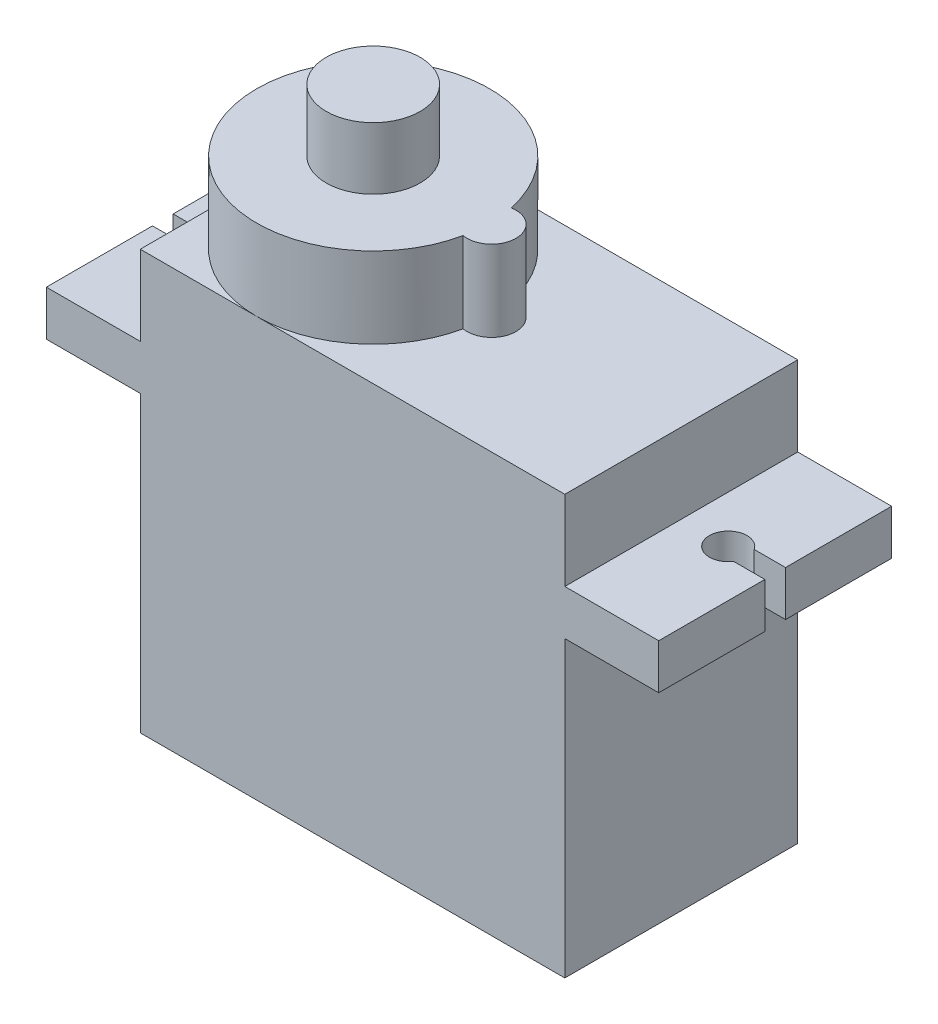
ISO-10303-21;
HEADER;
FILE_DESCRIPTION(('STEP AP214'),'2;1');
FILE_NAME('part.step','',(''),(''),'','','');
FILE_SCHEMA(('AUTOMOTIVE_DESIGN { 1 0 10303 214 1 1 1 1 }'));
ENDSEC;
DATA;
#1=APPLICATION_CONTEXT('core data for automotive mechanical design processes');
#2=APPLICATION_PROTOCOL_DEFINITION('international standard','automotive_design',2000,#1);
#3=PRODUCT_CONTEXT('',#1,'mechanical');
#4=PRODUCT('Part','Part','',(#3));
#5=PRODUCT_RELATED_PRODUCT_CATEGORY('part','',(#4));
#6=PRODUCT_DEFINITION_FORMATION('','',#4);
#7=PRODUCT_DEFINITION_CONTEXT('part definition',#1,'design');
#8=PRODUCT_DEFINITION('design','',#6,#7);
#9=PRODUCT_DEFINITION_SHAPE('','',#8);
#10=(LENGTH_UNIT() NAMED_UNIT(*) SI_UNIT(.MILLI.,.METRE.));
#11=(NAMED_UNIT(*) PLANE_ANGLE_UNIT() SI_UNIT($,.RADIAN.));
#12=(NAMED_UNIT(*) SI_UNIT($,.STERADIAN.) SOLID_ANGLE_UNIT());
#13=UNCERTAINTY_MEASURE_WITH_UNIT(LENGTH_MEASURE(1.E-05),#10,'distance_accuracy_value','');
#14=(GEOMETRIC_REPRESENTATION_CONTEXT(3) GLOBAL_UNCERTAINTY_ASSIGNED_CONTEXT((#13)) GLOBAL_UNIT_ASSIGNED_CONTEXT((#10,
#11,#12)) REPRESENTATION_CONTEXT('',''));
#15=CARTESIAN_POINT('',(0.,0.,0.));
#16=DIRECTION('',(0.,0.,1.));
#17=DIRECTION('',(1.,0.,0.));
#18=AXIS2_PLACEMENT_3D('',#15,#16,#17);
#19=CARTESIAN_POINT('',(-13.6,4.5,1.2));
#20=DIRECTION('',(1.,0.,0.));
#21=DIRECTION('',(0.,0.,-1.));
#22=AXIS2_PLACEMENT_3D('',#19,#20,#21);
#23=CYLINDRICAL_SURFACE('',#22,0.6);
#24=CARTESIAN_POINT('',(-13.6,4.5,1.2));
#25=DIRECTION('',(-1.,0.,0.));
#26=DIRECTION('',(0.,0.,1.));
#27=AXIS2_PLACEMENT_3D('',#24,#25,#26);
#28=CIRCLE('',#27,0.6);
#29=CARTESIAN_POINT('',(-13.6,4.5,1.8));
#30=VERTEX_POINT('',#29);
#31=EDGE_CURVE('E12',#30,#30,#28,.T.);
#32=ORIENTED_EDGE('',*,*,#31,.F.);
#33=EDGE_LOOP('',(#32));
#34=FACE_BOUND('',#33,.T.);
#35=CARTESIAN_POINT('',(-11.3,4.5,1.2));
#36=DIRECTION('',(-1.,0.,0.));
#37=DIRECTION('',(0.,0.,1.));
#38=AXIS2_PLACEMENT_3D('',#35,#36,#37);
#39=CIRCLE('',#38,0.6);
#40=CARTESIAN_POINT('',(-11.3,4.5,1.8));
#41=VERTEX_POINT('',#40);
#42=EDGE_CURVE('E54',#41,#41,#39,.T.);
#43=ORIENTED_EDGE('',*,*,#42,.T.);
#44=EDGE_LOOP('',(#43));
#45=FACE_BOUND('',#44,.T.);
#46=ADVANCED_FACE('F51',(#34,#45),#23,.T.);
#47=CARTESIAN_POINT('',(-13.6,0.,0.));
#48=DIRECTION('',(-1.,0.,0.));
#49=DIRECTION('',(0.,0.,1.));
#50=AXIS2_PLACEMENT_3D('',#47,#48,#49);
#51=PLANE('',#50);
#52=ORIENTED_EDGE('',*,*,#31,.T.);
#53=EDGE_LOOP('',(#52));
#54=FACE_BOUND('',#53,.T.);
#55=ADVANCED_FACE('F66',(#54),#51,.T.);
#56=CARTESIAN_POINT('',(-11.3,0.,0.));
#57=DIRECTION('',(-1.,0.,0.));
#58=DIRECTION('',(0.,0.,1.));
#59=AXIS2_PLACEMENT_3D('',#56,#57,#58);
#60=PLANE('',#59);
#61=ORIENTED_EDGE('',*,*,#42,.F.);
#62=EDGE_LOOP('',(#61));
#63=FACE_BOUND('',#62,.T.);
#64=ADVANCED_FACE('F64',(#63),#60,.F.);
#65=CLOSED_SHELL('',(#46,#55,#64));
#66=MANIFOLD_SOLID_BREP('B2',#65);
#67=CARTESIAN_POINT('',(-13.6,4.5,-1.2));
#68=DIRECTION('',(1.,0.,0.));
#69=DIRECTION('',(0.,0.,-1.));
#70=AXIS2_PLACEMENT_3D('',#67,#68,#69);
#71=CYLINDRICAL_SURFACE('',#70,0.6);
#72=CARTESIAN_POINT('',(-13.6,4.5,-1.2));
#73=DIRECTION('',(-1.,0.,0.));
#74=DIRECTION('',(0.,0.,1.));
#75=AXIS2_PLACEMENT_3D('',#72,#73,#74);
#76=CIRCLE('',#75,0.6);
#77=CARTESIAN_POINT('',(-13.6,4.5,-0.600000000000001));
#78=VERTEX_POINT('',#77);
#79=EDGE_CURVE('E50',#78,#78,#76,.T.);
#80=ORIENTED_EDGE('',*,*,#79,.F.);
#81=EDGE_LOOP('',(#80));
#82=FACE_BOUND('',#81,.T.);
#83=CARTESIAN_POINT('',(-11.3,4.5,-1.2));
#84=DIRECTION('',(-1.,0.,0.));
#85=DIRECTION('',(0.,0.,1.));
#86=AXIS2_PLACEMENT_3D('',#83,#84,#85);
#87=CIRCLE('',#86,0.6);
#88=CARTESIAN_POINT('',(-11.3,4.5,-0.600000000000001));
#89=VERTEX_POINT('',#88);
#90=EDGE_CURVE('E106',#89,#89,#87,.T.);
#91=ORIENTED_EDGE('',*,*,#90,.T.);
#92=EDGE_LOOP('',(#91));
#93=FACE_BOUND('',#92,.T.);
#94=ADVANCED_FACE('F103',(#82,#93),#71,.T.);
#95=CARTESIAN_POINT('',(-13.6,0.,0.));
#96=DIRECTION('',(-1.,0.,0.));
#97=DIRECTION('',(0.,0.,1.));
#98=AXIS2_PLACEMENT_3D('',#95,#96,#97);
#99=PLANE('',#98);
#100=ORIENTED_EDGE('',*,*,#79,.T.);
#101=EDGE_LOOP('',(#100));
#102=FACE_BOUND('',#101,.T.);
#103=ADVANCED_FACE('F118',(#102),#99,.T.);
#104=CARTESIAN_POINT('',(-11.3,0.,0.));
#105=DIRECTION('',(-1.,0.,0.));
#106=DIRECTION('',(0.,0.,1.));
#107=AXIS2_PLACEMENT_3D('',#104,#105,#106);
#108=PLANE('',#107);
#109=ORIENTED_EDGE('',*,*,#90,.F.);
#110=EDGE_LOOP('',(#109));
#111=FACE_BOUND('',#110,.T.);
#112=ADVANCED_FACE('F116',(#111),#108,.F.);
#113=CLOSED_SHELL('',(#94,#103,#112));
#114=MANIFOLD_SOLID_BREP('B7',#113);
#115=CARTESIAN_POINT('',(-13.6,4.5,0.));
#116=DIRECTION('',(1.,0.,0.));
#117=DIRECTION('',(0.,0.,-1.));
#118=AXIS2_PLACEMENT_3D('',#115,#116,#117);
#119=CYLINDRICAL_SURFACE('',#118,0.6);
#120=CARTESIAN_POINT('',(-13.6,4.5,0.));
#121=DIRECTION('',(-1.,0.,0.));
#122=DIRECTION('',(0.,0.,1.));
#123=AXIS2_PLACEMENT_3D('',#120,#121,#122);
#124=CIRCLE('',#123,0.6);
#125=CARTESIAN_POINT('',(-13.6,4.5,0.599999999999999));
#126=VERTEX_POINT('',#125);
#127=EDGE_CURVE('E102',#126,#126,#124,.T.);
#128=ORIENTED_EDGE('',*,*,#127,.F.);
#129=EDGE_LOOP('',(#128));
#130=FACE_BOUND('',#129,.T.);
#131=CARTESIAN_POINT('',(-11.3,4.5,0.));
#132=DIRECTION('',(-1.,0.,0.));
#133=DIRECTION('',(0.,0.,1.));
#134=AXIS2_PLACEMENT_3D('',#131,#132,#133);
#135=CIRCLE('',#134,0.6);
#136=CARTESIAN_POINT('',(-11.3,4.5,0.599999999999999));
#137=VERTEX_POINT('',#136);
#138=EDGE_CURVE('E159',#137,#137,#135,.T.);
#139=ORIENTED_EDGE('',*,*,#138,.T.);
#140=EDGE_LOOP('',(#139));
#141=FACE_BOUND('',#140,.T.);
#142=ADVANCED_FACE('F156',(#130,#141),#119,.T.);
#143=CARTESIAN_POINT('',(-13.6,0.,0.));
#144=DIRECTION('',(-1.,0.,0.));
#145=DIRECTION('',(0.,0.,1.));
#146=AXIS2_PLACEMENT_3D('',#143,#144,#145);
#147=PLANE('',#146);
#148=ORIENTED_EDGE('',*,*,#127,.T.);
#149=EDGE_LOOP('',(#148));
#150=FACE_BOUND('',#149,.T.);
#151=ADVANCED_FACE('F171',(#150),#147,.T.);
#152=CARTESIAN_POINT('',(-11.3,0.,0.));
#153=DIRECTION('',(-1.,0.,0.));
#154=DIRECTION('',(0.,0.,1.));
#155=AXIS2_PLACEMENT_3D('',#152,#153,#154);
#156=PLANE('',#155);
#157=ORIENTED_EDGE('',*,*,#138,.F.);
#158=EDGE_LOOP('',(#157));
#159=FACE_BOUND('',#158,.T.);
#160=ADVANCED_FACE('F169',(#159),#156,.F.);
#161=CLOSED_SHELL('',(#142,#151,#160));
#162=MANIFOLD_SOLID_BREP('B45',#161);
#163=CARTESIAN_POINT('',(0.,22.3,0.));
#164=DIRECTION('',(0.,-1.,0.));
#165=DIRECTION('',(0.,0.,-1.));
#166=AXIS2_PLACEMENT_3D('',#163,#164,#165);
#167=PLANE('',#166);
#168=CARTESIAN_POINT('',(1.2,22.3,0.));
#169=DIRECTION('',(0.,1.,0.));
#170=DIRECTION('',(0.,0.,1.));
#171=AXIS2_PLACEMENT_3D('',#168,#169,#170);
#172=CIRCLE('',#171,1.3);
#173=CARTESIAN_POINT('',(0.966666666666667,22.3,1.27888840621673));
#174=VERTEX_POINT('',#173);
#175=CARTESIAN_POINT('',(0.966666666666667,22.3,-1.27888840621673));
#176=VERTEX_POINT('',#175);
#177=EDGE_CURVE('E375',#174,#176,#172,.T.);
#178=ORIENTED_EDGE('',*,*,#177,.F.);
#179=CARTESIAN_POINT('',(-5.1,22.3,0.));
#180=DIRECTION('',(0.,1.,0.));
#181=DIRECTION('',(0.,0.,1.));
#182=AXIS2_PLACEMENT_3D('',#179,#180,#181);
#183=CIRCLE('',#182,6.2);
#184=CARTESIAN_POINT('',(-5.1,22.3,6.2));
#185=VERTEX_POINT('',#184);
#186=EDGE_CURVE('E223',#185,#174,#183,.T.);
#187=ORIENTED_EDGE('',*,*,#186,.F.);
#188=DIRECTION('',(1.,0.,0.));
#189=VECTOR('',#188,1.);
#190=CARTESIAN_POINT('',(-11.3,22.3,6.2));
#191=LINE('',#190,#189);
#192=CARTESIAN_POINT('',(11.3,22.3,6.2));
#193=VERTEX_POINT('',#192);
#194=EDGE_CURVE('E503',#185,#193,#191,.T.);
#195=ORIENTED_EDGE('',*,*,#194,.T.);
#196=DIRECTION('',(0.,0.,-1.));
#197=VECTOR('',#196,1.);
#198=CARTESIAN_POINT('',(11.3,22.3,6.2));
#199=LINE('',#198,#197);
#200=CARTESIAN_POINT('',(11.3,22.3,-6.2));
#201=VERTEX_POINT('',#200);
#202=EDGE_CURVE('E492',#193,#201,#199,.T.);
#203=ORIENTED_EDGE('',*,*,#202,.T.);
#204=DIRECTION('',(-1.,0.,0.));
#205=VECTOR('',#204,1.);
#206=CARTESIAN_POINT('',(-11.3,22.3,-6.2));
#207=LINE('',#206,#205);
#208=CARTESIAN_POINT('',(-5.1,22.3,-6.2));
#209=VERTEX_POINT('',#208);
#210=EDGE_CURVE('E497',#201,#209,#207,.T.);
#211=ORIENTED_EDGE('',*,*,#210,.T.);
#212=EDGE_CURVE('E217',#176,#209,#183,.T.);
#213=ORIENTED_EDGE('',*,*,#212,.F.);
#214=EDGE_LOOP('',(#178,#187,#195,#203,#211,#213));
#215=FACE_BOUND('',#214,.T.);
#216=ADVANCED_FACE('F200',(#215),#167,.F.);
#217=CARTESIAN_POINT('',(-11.3,22.3,0.));
#218=VERTEX_POINT('',#217);
#219=EDGE_CURVE('E209',#209,#218,#183,.T.);
#220=ORIENTED_EDGE('',*,*,#219,.F.);
#221=CARTESIAN_POINT('',(-11.3,22.3,-6.2));
#222=VERTEX_POINT('',#221);
#223=EDGE_CURVE('E495',#209,#222,#207,.T.);
#224=ORIENTED_EDGE('',*,*,#223,.T.);
#225=DIRECTION('',(0.,0.,1.));
#226=VECTOR('',#225,1.);
#227=CARTESIAN_POINT('',(-11.3,22.3,6.2));
#228=LINE('',#227,#226);
#229=EDGE_CURVE('E500',#222,#218,#228,.T.);
#230=ORIENTED_EDGE('',*,*,#229,.T.);
#231=EDGE_LOOP('',(#220,#224,#230));
#232=FACE_BOUND('',#231,.T.);
#233=ADVANCED_FACE('F593',(#232),#167,.F.);
#234=CARTESIAN_POINT('',(16.3,0.,0.));
#235=DIRECTION('',(1.,0.,0.));
#236=DIRECTION('',(0.,0.,-1.));
#237=AXIS2_PLACEMENT_3D('',#234,#235,#236);
#238=PLANE('',#237);
#239=DIRECTION('',(0.,1.,0.));
#240=VECTOR('',#239,1.);
#241=CARTESIAN_POINT('',(16.3,-0.001000000000001,-0.550000000000001));
#242=LINE('',#241,#240);
#243=CARTESIAN_POINT('',(16.3,15.65,-0.550000000000001));
#244=VERTEX_POINT('',#243);
#245=CARTESIAN_POINT('',(16.3,18.05,-0.550000000000001));
#246=VERTEX_POINT('',#245);
#247=EDGE_CURVE('E402',#244,#246,#242,.T.);
#248=ORIENTED_EDGE('',*,*,#247,.F.);
#249=DIRECTION('',(0.,0.,-1.));
#250=VECTOR('',#249,1.);
#251=CARTESIAN_POINT('',(16.3,15.65,6.2));
#252=LINE('',#251,#250);
#253=CARTESIAN_POINT('',(16.3,15.65,-6.2));
#254=VERTEX_POINT('',#253);
#255=EDGE_CURVE('E464',#244,#254,#252,.T.);
#256=ORIENTED_EDGE('',*,*,#255,.T.);
#257=DIRECTION('',(0.,1.,0.));
#258=VECTOR('',#257,1.);
#259=CARTESIAN_POINT('',(16.3,18.05,-6.2));
#260=LINE('',#259,#258);
#261=CARTESIAN_POINT('',(16.3,18.05,-6.2));
#262=VERTEX_POINT('',#261);
#263=EDGE_CURVE('E469',#254,#262,#260,.T.);
#264=ORIENTED_EDGE('',*,*,#263,.T.);
#265=DIRECTION('',(0.,0.,1.));
#266=VECTOR('',#265,1.);
#267=CARTESIAN_POINT('',(16.3,18.05,6.2));
#268=LINE('',#267,#266);
#269=EDGE_CURVE('E472',#262,#246,#268,.T.);
#270=ORIENTED_EDGE('',*,*,#269,.T.);
#271=EDGE_LOOP('',(#248,#256,#264,#270));
#272=FACE_BOUND('',#271,.T.);
#273=ADVANCED_FACE('F598',(#272),#238,.T.);
#274=CARTESIAN_POINT('',(-16.3,0.,0.));
#275=DIRECTION('',(-1.,0.,0.));
#276=DIRECTION('',(0.,0.,1.));
#277=AXIS2_PLACEMENT_3D('',#274,#275,#276);
#278=PLANE('',#277);
#279=DIRECTION('',(0.,1.,0.));
#280=VECTOR('',#279,1.);
#281=CARTESIAN_POINT('',(-16.3,-0.001000000000001,-0.55));
#282=LINE('',#281,#280);
#283=CARTESIAN_POINT('',(-16.3,15.65,-0.55));
#284=VERTEX_POINT('',#283);
#285=CARTESIAN_POINT('',(-16.3,18.05,-0.55));
#286=VERTEX_POINT('',#285);
#287=EDGE_CURVE('E422',#284,#286,#282,.T.);
#288=ORIENTED_EDGE('',*,*,#287,.T.);
#289=DIRECTION('',(0.,0.,-1.));
#290=VECTOR('',#289,1.);
#291=CARTESIAN_POINT('',(-16.3,18.05,6.2));
#292=LINE('',#291,#290);
#293=CARTESIAN_POINT('',(-16.3,18.05,-6.2));
#294=VERTEX_POINT('',#293);
#295=EDGE_CURVE('E435',#286,#294,#292,.T.);
#296=ORIENTED_EDGE('',*,*,#295,.T.);
#297=DIRECTION('',(0.,-1.,0.));
#298=VECTOR('',#297,1.);
#299=CARTESIAN_POINT('',(-16.3,18.05,-6.2));
#300=LINE('',#299,#298);
#301=CARTESIAN_POINT('',(-16.3,15.65,-6.2));
#302=VERTEX_POINT('',#301);
#303=EDGE_CURVE('E434',#294,#302,#300,.T.);
#304=ORIENTED_EDGE('',*,*,#303,.T.);
#305=DIRECTION('',(0.,0.,1.));
#306=VECTOR('',#305,1.);
#307=CARTESIAN_POINT('',(-16.3,15.65,-6.2));
#308=LINE('',#307,#306);
#309=EDGE_CURVE('E438',#302,#284,#308,.T.);
#310=ORIENTED_EDGE('',*,*,#309,.T.);
#311=EDGE_LOOP('',(#288,#296,#304,#310));
#312=FACE_BOUND('',#311,.T.);
#313=ADVANCED_FACE('F615',(#312),#278,.T.);
#314=CARTESIAN_POINT('',(-11.3,22.3,6.2));
#315=DIRECTION('',(1.,0.,0.));
#316=DIRECTION('',(0.,0.,-1.));
#317=AXIS2_PLACEMENT_3D('',#314,#315,#316);
#318=PLANE('',#317);
#319=DIRECTION('',(0.,0.,-1.));
#320=VECTOR('',#319,1.);
#321=CARTESIAN_POINT('',(-11.3,18.05,6.2));
#322=LINE('',#321,#320);
#323=CARTESIAN_POINT('',(-11.3,18.05,6.2));
#324=VERTEX_POINT('',#323);
#325=CARTESIAN_POINT('',(-11.3,18.05,-6.2));
#326=VERTEX_POINT('',#325);
#327=EDGE_CURVE('E409',#324,#326,#322,.T.);
#328=ORIENTED_EDGE('',*,*,#327,.F.);
#329=DIRECTION('',(0.,-1.,0.));
#330=VECTOR('',#329,1.);
#331=CARTESIAN_POINT('',(-11.3,22.3,6.2));
#332=LINE('',#331,#330);
#333=CARTESIAN_POINT('',(-11.3,22.3,6.2));
#334=VERTEX_POINT('',#333);
#335=EDGE_CURVE('E521',#334,#324,#332,.T.);
#336=ORIENTED_EDGE('',*,*,#335,.F.);
#337=EDGE_CURVE('E499',#218,#334,#228,.T.);
#338=ORIENTED_EDGE('',*,*,#337,.F.);
#339=ORIENTED_EDGE('',*,*,#229,.F.);
#340=DIRECTION('',(0.,-1.,0.));
#341=VECTOR('',#340,1.);
#342=CARTESIAN_POINT('',(-11.3,22.3,-6.2));
#343=LINE('',#342,#341);
#344=EDGE_CURVE('E524',#222,#326,#343,.T.);
#345=ORIENTED_EDGE('',*,*,#344,.T.);
#346=EDGE_LOOP('',(#328,#336,#338,#339,#345));
#347=FACE_BOUND('',#346,.T.);
#348=ADVANCED_FACE('F563',(#347),#318,.F.);
#349=DIRECTION('',(0.,0.,1.));
#350=VECTOR('',#349,1.);
#351=CARTESIAN_POINT('',(-11.3,15.65,-6.2));
#352=LINE('',#351,#350);
#353=CARTESIAN_POINT('',(-11.3,15.65,-6.2));
#354=VERTEX_POINT('',#353);
#355=CARTESIAN_POINT('',(-11.3,15.65,6.2));
#356=VERTEX_POINT('',#355);
#357=EDGE_CURVE('E446',#354,#356,#352,.T.);
#358=ORIENTED_EDGE('',*,*,#357,.F.);
#359=CARTESIAN_POINT('',(-11.3,0.,-6.2));
#360=VERTEX_POINT('',#359);
#361=EDGE_CURVE('E523',#354,#360,#343,.T.);
#362=ORIENTED_EDGE('',*,*,#361,.T.);
#363=DIRECTION('',(0.,0.,1.));
#364=VECTOR('',#363,1.);
#365=CARTESIAN_POINT('',(-11.3,0.,6.2));
#366=LINE('',#365,#364);
#367=CARTESIAN_POINT('',(-11.3,0.,6.2));
#368=VERTEX_POINT('',#367);
#369=EDGE_CURVE('E513',#360,#368,#366,.T.);
#370=ORIENTED_EDGE('',*,*,#369,.T.);
#371=EDGE_CURVE('E520',#356,#368,#332,.T.);
#372=ORIENTED_EDGE('',*,*,#371,.F.);
#373=EDGE_LOOP('',(#358,#362,#370,#372));
#374=FACE_BOUND('',#373,.T.);
#375=ADVANCED_FACE('F531',(#374),#318,.F.);
#376=CARTESIAN_POINT('',(11.3,22.3,6.2));
#377=DIRECTION('',(-1.,0.,0.));
#378=DIRECTION('',(0.,0.,1.));
#379=AXIS2_PLACEMENT_3D('',#376,#377,#378);
#380=PLANE('',#379);
#381=DIRECTION('',(0.,0.,1.));
#382=VECTOR('',#381,1.);
#383=CARTESIAN_POINT('',(11.3,18.05,6.2));
#384=LINE('',#383,#382);
#385=CARTESIAN_POINT('',(11.3,18.05,-6.2));
#386=VERTEX_POINT('',#385);
#387=CARTESIAN_POINT('',(11.3,18.05,6.2));
#388=VERTEX_POINT('',#387);
#389=EDGE_CURVE('E465',#386,#388,#384,.T.);
#390=ORIENTED_EDGE('',*,*,#389,.F.);
#391=DIRECTION('',(0.,-1.,0.));
#392=VECTOR('',#391,1.);
#393=CARTESIAN_POINT('',(11.3,22.3,-6.2));
#394=LINE('',#393,#392);
#395=EDGE_CURVE('E204',#201,#386,#394,.T.);
#396=ORIENTED_EDGE('',*,*,#395,.F.);
#397=ORIENTED_EDGE('',*,*,#202,.F.);
#398=DIRECTION('',(0.,-1.,0.));
#399=VECTOR('',#398,1.);
#400=CARTESIAN_POINT('',(11.3,22.3,6.2));
#401=LINE('',#400,#399);
#402=EDGE_CURVE('E518',#193,#388,#401,.T.);
#403=ORIENTED_EDGE('',*,*,#402,.T.);
#404=EDGE_LOOP('',(#390,#396,#397,#403));
#405=FACE_BOUND('',#404,.T.);
#406=ADVANCED_FACE('F202',(#405),#380,.F.);
#407=DIRECTION('',(0.,0.,-1.));
#408=VECTOR('',#407,1.);
#409=CARTESIAN_POINT('',(11.3,15.65,6.2));
#410=LINE('',#409,#408);
#411=CARTESIAN_POINT('',(11.3,15.65,6.2));
#412=VERTEX_POINT('',#411);
#413=CARTESIAN_POINT('',(11.3,15.65,-6.2));
#414=VERTEX_POINT('',#413);
#415=EDGE_CURVE('E460',#412,#414,#410,.T.);
#416=ORIENTED_EDGE('',*,*,#415,.F.);
#417=CARTESIAN_POINT('',(11.3,0.,6.2));
#418=VERTEX_POINT('',#417);
#419=EDGE_CURVE('E507',#412,#418,#401,.T.);
#420=ORIENTED_EDGE('',*,*,#419,.T.);
#421=DIRECTION('',(0.,0.,-1.));
#422=VECTOR('',#421,1.);
#423=CARTESIAN_POINT('',(11.3,0.,6.2));
#424=LINE('',#423,#422);
#425=CARTESIAN_POINT('',(11.3,0.,-6.2));
#426=VERTEX_POINT('',#425);
#427=EDGE_CURVE('E491',#418,#426,#424,.T.);
#428=ORIENTED_EDGE('',*,*,#427,.T.);
#429=EDGE_CURVE('E525',#414,#426,#394,.T.);
#430=ORIENTED_EDGE('',*,*,#429,.F.);
#431=EDGE_LOOP('',(#416,#420,#428,#430));
#432=FACE_BOUND('',#431,.T.);
#433=ADVANCED_FACE('F612',(#432),#380,.F.);
#434=CARTESIAN_POINT('',(-11.3,22.3,-6.2));
#435=DIRECTION('',(0.,0.,1.));
#436=DIRECTION('',(1.,0.,0.));
#437=AXIS2_PLACEMENT_3D('',#434,#435,#436);
#438=PLANE('',#437);
#439=DIRECTION('',(-1.,0.,0.));
#440=VECTOR('',#439,1.);
#441=CARTESIAN_POINT('',(-11.3,0.,-6.2));
#442=LINE('',#441,#440);
#443=EDGE_CURVE('E510',#426,#360,#442,.T.);
#444=ORIENTED_EDGE('',*,*,#443,.T.);
#445=ORIENTED_EDGE('',*,*,#361,.F.);
#446=DIRECTION('',(1.,0.,0.));
#447=VECTOR('',#446,1.);
#448=CARTESIAN_POINT('',(-16.3,15.65,-6.2));
#449=LINE('',#448,#447);
#450=EDGE_CURVE('E454',#302,#354,#449,.T.);
#451=ORIENTED_EDGE('',*,*,#450,.F.);
#452=ORIENTED_EDGE('',*,*,#303,.F.);
#453=DIRECTION('',(1.,0.,0.));
#454=VECTOR('',#453,1.);
#455=CARTESIAN_POINT('',(-16.3,18.05,-6.2));
#456=LINE('',#455,#454);
#457=EDGE_CURVE('E457',#294,#326,#456,.T.);
#458=ORIENTED_EDGE('',*,*,#457,.T.);
#459=ORIENTED_EDGE('',*,*,#344,.F.);
#460=ORIENTED_EDGE('',*,*,#223,.F.);
#461=ORIENTED_EDGE('',*,*,#210,.F.);
#462=ORIENTED_EDGE('',*,*,#395,.T.);
#463=DIRECTION('',(-1.,0.,0.));
#464=VECTOR('',#463,1.);
#465=CARTESIAN_POINT('',(16.3,18.05,-6.2));
#466=LINE('',#465,#464);
#467=EDGE_CURVE('E482',#262,#386,#466,.T.);
#468=ORIENTED_EDGE('',*,*,#467,.F.);
#469=ORIENTED_EDGE('',*,*,#263,.F.);
#470=DIRECTION('',(-1.,0.,0.));
#471=VECTOR('',#470,1.);
#472=CARTESIAN_POINT('',(16.3,15.65,-6.2));
#473=LINE('',#472,#471);
#474=EDGE_CURVE('E485',#254,#414,#473,.T.);
#475=ORIENTED_EDGE('',*,*,#474,.T.);
#476=ORIENTED_EDGE('',*,*,#429,.T.);
#477=EDGE_LOOP('',(#444,#445,#451,#452,#458,#459,#460,#461,#462,#468,#469,#475,#476));
#478=FACE_BOUND('',#477,.T.);
#479=ADVANCED_FACE('F537',(#478),#438,.F.);
#480=CARTESIAN_POINT('',(-11.3,22.3,6.2));
#481=DIRECTION('',(0.,0.,-1.));
#482=DIRECTION('',(-1.,0.,0.));
#483=AXIS2_PLACEMENT_3D('',#480,#481,#482);
#484=PLANE('',#483);
#485=DIRECTION('',(1.,0.,0.));
#486=VECTOR('',#485,1.);
#487=CARTESIAN_POINT('',(-11.3,0.,6.2));
#488=LINE('',#487,#486);
#489=EDGE_CURVE('E496',#368,#418,#488,.T.);
#490=ORIENTED_EDGE('',*,*,#489,.T.);
#491=ORIENTED_EDGE('',*,*,#419,.F.);
#492=DIRECTION('',(-1.,0.,0.));
#493=VECTOR('',#492,1.);
#494=CARTESIAN_POINT('',(16.3,15.65,6.2));
#495=LINE('',#494,#493);
#496=CARTESIAN_POINT('',(16.3,15.65,6.2));
#497=VERTEX_POINT('',#496);
#498=EDGE_CURVE('E488',#497,#412,#495,.T.);
#499=ORIENTED_EDGE('',*,*,#498,.F.);
#500=DIRECTION('',(0.,-1.,0.));
#501=VECTOR('',#500,1.);
#502=CARTESIAN_POINT('',(16.3,18.05,6.2));
#503=LINE('',#502,#501);
#504=CARTESIAN_POINT('',(16.3,18.05,6.2));
#505=VERTEX_POINT('',#504);
#506=EDGE_CURVE('E461',#505,#497,#503,.T.);
#507=ORIENTED_EDGE('',*,*,#506,.F.);
#508=DIRECTION('',(-1.,0.,0.));
#509=VECTOR('',#508,1.);
#510=CARTESIAN_POINT('',(16.3,18.05,6.2));
#511=LINE('',#510,#509);
#512=EDGE_CURVE('E475',#505,#388,#511,.T.);
#513=ORIENTED_EDGE('',*,*,#512,.T.);
#514=ORIENTED_EDGE('',*,*,#402,.F.);
#515=ORIENTED_EDGE('',*,*,#194,.F.);
#516=EDGE_CURVE('E504',#334,#185,#191,.T.);
#517=ORIENTED_EDGE('',*,*,#516,.F.);
#518=ORIENTED_EDGE('',*,*,#335,.T.);
#519=DIRECTION('',(1.,0.,0.));
#520=VECTOR('',#519,1.);
#521=CARTESIAN_POINT('',(-16.3,18.05,6.2));
#522=LINE('',#521,#520);
#523=CARTESIAN_POINT('',(-16.3,18.05,6.2));
#524=VERTEX_POINT('',#523);
#525=EDGE_CURVE('E443',#524,#324,#522,.T.);
#526=ORIENTED_EDGE('',*,*,#525,.F.);
#527=DIRECTION('',(0.,1.,0.));
#528=VECTOR('',#527,1.);
#529=CARTESIAN_POINT('',(-16.3,15.65,6.2));
#530=LINE('',#529,#528);
#531=CARTESIAN_POINT('',(-16.3,15.65,6.2));
#532=VERTEX_POINT('',#531);
#533=EDGE_CURVE('E441',#532,#524,#530,.T.);
#534=ORIENTED_EDGE('',*,*,#533,.F.);
#535=DIRECTION('',(1.,0.,0.));
#536=VECTOR('',#535,1.);
#537=CARTESIAN_POINT('',(-16.3,15.65,6.2));
#538=LINE('',#537,#536);
#539=EDGE_CURVE('E451',#532,#356,#538,.T.);
#540=ORIENTED_EDGE('',*,*,#539,.T.);
#541=ORIENTED_EDGE('',*,*,#371,.T.);
#542=EDGE_LOOP('',(#490,#491,#499,#507,#513,#514,#515,#517,#518,#526,#534,#540,#541));
#543=FACE_BOUND('',#542,.T.);
#544=ADVANCED_FACE('F543',(#543),#484,.F.);
#545=EDGE_CURVE('E570',#218,#185,#183,.T.);
#546=ORIENTED_EDGE('',*,*,#545,.F.);
#547=ORIENTED_EDGE('',*,*,#337,.T.);
#548=ORIENTED_EDGE('',*,*,#516,.T.);
#549=EDGE_LOOP('',(#546,#547,#548));
#550=FACE_BOUND('',#549,.T.);
#551=ADVANCED_FACE('F569',(#550),#167,.F.);
#552=CARTESIAN_POINT('',(0.,0.,0.));
#553=DIRECTION('',(0.,-1.,0.));
#554=DIRECTION('',(0.,0.,-1.));
#555=AXIS2_PLACEMENT_3D('',#552,#553,#554);
#556=PLANE('',#555);
#557=ORIENTED_EDGE('',*,*,#427,.F.);
#558=ORIENTED_EDGE('',*,*,#489,.F.);
#559=ORIENTED_EDGE('',*,*,#369,.F.);
#560=ORIENTED_EDGE('',*,*,#443,.F.);
#561=EDGE_LOOP('',(#557,#558,#559,#560));
#562=FACE_BOUND('',#561,.T.);
#563=ADVANCED_FACE('F540',(#562),#556,.T.);
#564=CARTESIAN_POINT('',(16.3,15.65,6.2));
#565=DIRECTION('',(0.,1.,0.));
#566=DIRECTION('',(0.,0.,1.));
#567=AXIS2_PLACEMENT_3D('',#564,#565,#566);
#568=PLANE('',#567);
#569=ORIENTED_EDGE('',*,*,#255,.F.);
#570=DIRECTION('',(1.,0.,0.));
#571=VECTOR('',#570,1.);
#572=CARTESIAN_POINT('',(16.3,15.65,-0.550000000000001));
#573=LINE('',#572,#571);
#574=CARTESIAN_POINT('',(14.6351646544245,15.65,-0.550000000000001));
#575=VERTEX_POINT('',#574);
#576=EDGE_CURVE('E387',#575,#244,#573,.T.);
#577=ORIENTED_EDGE('',*,*,#576,.F.);
#578=CARTESIAN_POINT('',(13.8,15.65,0.));
#579=DIRECTION('',(0.,1.,0.));
#580=DIRECTION('',(0.,0.,1.));
#581=AXIS2_PLACEMENT_3D('',#578,#579,#580);
#582=CIRCLE('',#581,1.);
#583=CARTESIAN_POINT('',(14.6351646544245,15.65,0.549999999999999));
#584=VERTEX_POINT('',#583);
#585=EDGE_CURVE('E384',#584,#575,#582,.F.);
#586=ORIENTED_EDGE('',*,*,#585,.F.);
#587=DIRECTION('',(-1.,0.,0.));
#588=VECTOR('',#587,1.);
#589=CARTESIAN_POINT('',(16.3,15.65,0.549999999999999));
#590=LINE('',#589,#588);
#591=CARTESIAN_POINT('',(16.3,15.65,0.549999999999999));
#592=VERTEX_POINT('',#591);
#593=EDGE_CURVE('E401',#592,#584,#590,.T.);
#594=ORIENTED_EDGE('',*,*,#593,.F.);
#595=EDGE_CURVE('E466',#497,#592,#252,.T.);
#596=ORIENTED_EDGE('',*,*,#595,.F.);
#597=ORIENTED_EDGE('',*,*,#498,.T.);
#598=ORIENTED_EDGE('',*,*,#415,.T.);
#599=ORIENTED_EDGE('',*,*,#474,.F.);
#600=EDGE_LOOP('',(#569,#577,#586,#594,#596,#597,#598,#599));
#601=FACE_BOUND('',#600,.T.);
#602=ADVANCED_FACE('F607',(#601),#568,.F.);
#603=CARTESIAN_POINT('',(16.3,18.05,6.2));
#604=DIRECTION('',(0.,-1.,0.));
#605=DIRECTION('',(0.,0.,-1.));
#606=AXIS2_PLACEMENT_3D('',#603,#604,#605);
#607=PLANE('',#606);
#608=CARTESIAN_POINT('',(13.8,18.05,0.));
#609=DIRECTION('',(0.,1.,0.));
#610=DIRECTION('',(0.,0.,1.));
#611=AXIS2_PLACEMENT_3D('',#608,#609,#610);
#612=CIRCLE('',#611,1.);
#613=CARTESIAN_POINT('',(14.6351646544245,18.05,-0.550000000000001));
#614=VERTEX_POINT('',#613);
#615=CARTESIAN_POINT('',(14.6351646544245,18.05,0.549999999999999));
#616=VERTEX_POINT('',#615);
#617=EDGE_CURVE('E390',#614,#616,#612,.T.);
#618=ORIENTED_EDGE('',*,*,#617,.F.);
#619=DIRECTION('',(-1.,0.,0.));
#620=VECTOR('',#619,1.);
#621=CARTESIAN_POINT('',(16.3,18.05,-0.550000000000001));
#622=LINE('',#621,#620);
#623=EDGE_CURVE('E395',#246,#614,#622,.T.);
#624=ORIENTED_EDGE('',*,*,#623,.F.);
#625=ORIENTED_EDGE('',*,*,#269,.F.);
#626=ORIENTED_EDGE('',*,*,#467,.T.);
#627=ORIENTED_EDGE('',*,*,#389,.T.);
#628=ORIENTED_EDGE('',*,*,#512,.F.);
#629=CARTESIAN_POINT('',(16.3,18.05,0.550000000000001));
#630=VERTEX_POINT('',#629);
#631=EDGE_CURVE('E471',#630,#505,#268,.T.);
#632=ORIENTED_EDGE('',*,*,#631,.F.);
#633=DIRECTION('',(1.,0.,0.));
#634=VECTOR('',#633,1.);
#635=CARTESIAN_POINT('',(16.3,18.05,0.549999999999999));
#636=LINE('',#635,#634);
#637=EDGE_CURVE('E393',#616,#630,#636,.T.);
#638=ORIENTED_EDGE('',*,*,#637,.F.);
#639=EDGE_LOOP('',(#618,#624,#625,#626,#627,#628,#632,#638));
#640=FACE_BOUND('',#639,.T.);
#641=ADVANCED_FACE('F798',(#640),#607,.F.);
#642=DIRECTION('',(0.,1.,0.));
#643=VECTOR('',#642,1.);
#644=CARTESIAN_POINT('',(16.3,-0.001000000000001,0.549999999999999));
#645=LINE('',#644,#643);
#646=EDGE_CURVE('E404',#592,#630,#645,.T.);
#647=ORIENTED_EDGE('',*,*,#646,.T.);
#648=ORIENTED_EDGE('',*,*,#631,.T.);
#649=ORIENTED_EDGE('',*,*,#506,.T.);
#650=ORIENTED_EDGE('',*,*,#595,.T.);
#651=EDGE_LOOP('',(#647,#648,#649,#650));
#652=FACE_BOUND('',#651,.T.);
#653=ADVANCED_FACE('F627',(#652),#238,.T.);
#654=CARTESIAN_POINT('',(-16.3,18.05,6.2));
#655=DIRECTION('',(0.,-1.,0.));
#656=DIRECTION('',(0.,0.,-1.));
#657=AXIS2_PLACEMENT_3D('',#654,#655,#656);
#658=PLANE('',#657);
#659=ORIENTED_EDGE('',*,*,#295,.F.);
#660=DIRECTION('',(-1.,0.,0.));
#661=VECTOR('',#660,1.);
#662=CARTESIAN_POINT('',(-16.3,18.05,-0.55));
#663=LINE('',#662,#661);
#664=CARTESIAN_POINT('',(-14.6351646544245,18.05,-0.55));
#665=VERTEX_POINT('',#664);
#666=EDGE_CURVE('E419',#665,#286,#663,.T.);
#667=ORIENTED_EDGE('',*,*,#666,.F.);
#668=CARTESIAN_POINT('',(-13.8,18.05,0.));
#669=DIRECTION('',(0.,1.,0.));
#670=DIRECTION('',(0.,0.,1.));
#671=AXIS2_PLACEMENT_3D('',#668,#669,#670);
#672=CIRCLE('',#671,1.);
#673=CARTESIAN_POINT('',(-14.6351646544245,18.05,0.55));
#674=VERTEX_POINT('',#673);
#675=EDGE_CURVE('E416',#674,#665,#672,.T.);
#676=ORIENTED_EDGE('',*,*,#675,.F.);
#677=DIRECTION('',(1.,0.,0.));
#678=VECTOR('',#677,1.);
#679=CARTESIAN_POINT('',(-16.3,18.05,0.55));
#680=LINE('',#679,#678);
#681=CARTESIAN_POINT('',(-16.3,18.05,0.55));
#682=VERTEX_POINT('',#681);
#683=EDGE_CURVE('E413',#682,#674,#680,.T.);
#684=ORIENTED_EDGE('',*,*,#683,.F.);
#685=EDGE_CURVE('E431',#524,#682,#292,.T.);
#686=ORIENTED_EDGE('',*,*,#685,.F.);
#687=ORIENTED_EDGE('',*,*,#525,.T.);
#688=ORIENTED_EDGE('',*,*,#327,.T.);
#689=ORIENTED_EDGE('',*,*,#457,.F.);
#690=EDGE_LOOP('',(#659,#667,#676,#684,#686,#687,#688,#689));
#691=FACE_BOUND('',#690,.T.);
#692=ADVANCED_FACE('F558',(#691),#658,.F.);
#693=CARTESIAN_POINT('',(-16.3,15.65,-6.2));
#694=DIRECTION('',(0.,1.,0.));
#695=DIRECTION('',(0.,0.,1.));
#696=AXIS2_PLACEMENT_3D('',#693,#694,#695);
#697=PLANE('',#696);
#698=CARTESIAN_POINT('',(-13.8,15.65,0.));
#699=DIRECTION('',(0.,1.,0.));
#700=DIRECTION('',(0.,0.,1.));
#701=AXIS2_PLACEMENT_3D('',#698,#699,#700);
#702=CIRCLE('',#701,1.);
#703=CARTESIAN_POINT('',(-14.6351646544245,15.65,-0.55));
#704=VERTEX_POINT('',#703);
#705=CARTESIAN_POINT('',(-14.6351646544245,15.65,0.55));
#706=VERTEX_POINT('',#705);
#707=EDGE_CURVE('E376',#704,#706,#702,.F.);
#708=ORIENTED_EDGE('',*,*,#707,.F.);
#709=DIRECTION('',(1.,0.,0.));
#710=VECTOR('',#709,1.);
#711=CARTESIAN_POINT('',(-16.3,15.65,-0.55));
#712=LINE('',#711,#710);
#713=EDGE_CURVE('E379',#284,#704,#712,.T.);
#714=ORIENTED_EDGE('',*,*,#713,.F.);
#715=ORIENTED_EDGE('',*,*,#309,.F.);
#716=ORIENTED_EDGE('',*,*,#450,.T.);
#717=ORIENTED_EDGE('',*,*,#357,.T.);
#718=ORIENTED_EDGE('',*,*,#539,.F.);
#719=CARTESIAN_POINT('',(-16.3,15.65,0.549999999999997));
#720=VERTEX_POINT('',#719);
#721=EDGE_CURVE('E437',#720,#532,#308,.T.);
#722=ORIENTED_EDGE('',*,*,#721,.F.);
#723=DIRECTION('',(-1.,0.,0.));
#724=VECTOR('',#723,1.);
#725=CARTESIAN_POINT('',(-16.3,15.65,0.55));
#726=LINE('',#725,#724);
#727=EDGE_CURVE('E388',#706,#720,#726,.T.);
#728=ORIENTED_EDGE('',*,*,#727,.F.);
#729=EDGE_LOOP('',(#708,#714,#715,#716,#717,#718,#722,#728));
#730=FACE_BOUND('',#729,.T.);
#731=ADVANCED_FACE('F549',(#730),#697,.F.);
#732=DIRECTION('',(0.,1.,0.));
#733=VECTOR('',#732,1.);
#734=CARTESIAN_POINT('',(-16.3,-0.001000000000001,0.55));
#735=LINE('',#734,#733);
#736=EDGE_CURVE('E421',#720,#682,#735,.T.);
#737=ORIENTED_EDGE('',*,*,#736,.F.);
#738=ORIENTED_EDGE('',*,*,#721,.T.);
#739=ORIENTED_EDGE('',*,*,#533,.T.);
#740=ORIENTED_EDGE('',*,*,#685,.T.);
#741=EDGE_LOOP('',(#737,#738,#739,#740));
#742=FACE_BOUND('',#741,.T.);
#743=ADVANCED_FACE('F621',(#742),#278,.T.);
#744=CARTESIAN_POINT('',(-16.3,-0.001000000000001,-0.55));
#745=DIRECTION('',(0.,0.,-1.));
#746=DIRECTION('',(-1.,0.,0.));
#747=AXIS2_PLACEMENT_3D('',#744,#745,#746);
#748=PLANE('',#747);
#749=ORIENTED_EDGE('',*,*,#713,.T.);
#750=DIRECTION('',(0.,1.,0.));
#751=VECTOR('',#750,1.);
#752=CARTESIAN_POINT('',(-14.6351646544245,-0.001000000000001,-0.55));
#753=LINE('',#752,#751);
#754=EDGE_CURVE('E425',#704,#665,#753,.T.);
#755=ORIENTED_EDGE('',*,*,#754,.T.);
#756=ORIENTED_EDGE('',*,*,#666,.T.);
#757=ORIENTED_EDGE('',*,*,#287,.F.);
#758=EDGE_LOOP('',(#749,#755,#756,#757));
#759=FACE_BOUND('',#758,.T.);
#760=ADVANCED_FACE('F631',(#759),#748,.F.);
#761=CARTESIAN_POINT('',(-13.8,-0.001000000000001,0.));
#762=DIRECTION('',(0.,1.,0.));
#763=DIRECTION('',(0.,0.,1.));
#764=AXIS2_PLACEMENT_3D('',#761,#762,#763);
#765=CYLINDRICAL_SURFACE('',#764,1.);
#766=ORIENTED_EDGE('',*,*,#707,.T.);
#767=DIRECTION('',(0.,1.,0.));
#768=VECTOR('',#767,1.);
#769=CARTESIAN_POINT('',(-14.6351646544245,-0.001000000000001,0.55));
#770=LINE('',#769,#768);
#771=EDGE_CURVE('E427',#706,#674,#770,.T.);
#772=ORIENTED_EDGE('',*,*,#771,.T.);
#773=ORIENTED_EDGE('',*,*,#675,.T.);
#774=ORIENTED_EDGE('',*,*,#754,.F.);
#775=EDGE_LOOP('',(#766,#772,#773,#774));
#776=FACE_BOUND('',#775,.T.);
#777=ADVANCED_FACE('F637',(#776),#765,.F.);
#778=CARTESIAN_POINT('',(-16.3,-0.001000000000001,0.55));
#779=DIRECTION('',(0.,0.,1.));
#780=DIRECTION('',(1.,0.,0.));
#781=AXIS2_PLACEMENT_3D('',#778,#779,#780);
#782=PLANE('',#781);
#783=ORIENTED_EDGE('',*,*,#727,.T.);
#784=ORIENTED_EDGE('',*,*,#736,.T.);
#785=ORIENTED_EDGE('',*,*,#683,.T.);
#786=ORIENTED_EDGE('',*,*,#771,.F.);
#787=EDGE_LOOP('',(#783,#784,#785,#786));
#788=FACE_BOUND('',#787,.T.);
#789=ADVANCED_FACE('F644',(#788),#782,.F.);
#790=CARTESIAN_POINT('',(13.8,-0.001000000000001,0.));
#791=DIRECTION('',(0.,1.,0.));
#792=DIRECTION('',(0.,0.,1.));
#793=AXIS2_PLACEMENT_3D('',#790,#791,#792);
#794=CYLINDRICAL_SURFACE('',#793,1.);
#795=ORIENTED_EDGE('',*,*,#585,.T.);
#796=DIRECTION('',(0.,1.,0.));
#797=VECTOR('',#796,1.);
#798=CARTESIAN_POINT('',(14.6351646544245,-0.001000000000001,-0.550000000000001));
#799=LINE('',#798,#797);
#800=EDGE_CURVE('E399',#575,#614,#799,.T.);
#801=ORIENTED_EDGE('',*,*,#800,.T.);
#802=ORIENTED_EDGE('',*,*,#617,.T.);
#803=DIRECTION('',(0.,1.,0.));
#804=VECTOR('',#803,1.);
#805=CARTESIAN_POINT('',(14.6351646544245,-0.001000000000001,0.549999999999999));
#806=LINE('',#805,#804);
#807=EDGE_CURVE('E398',#584,#616,#806,.T.);
#808=ORIENTED_EDGE('',*,*,#807,.F.);
#809=EDGE_LOOP('',(#795,#801,#802,#808));
#810=FACE_BOUND('',#809,.T.);
#811=ADVANCED_FACE('F652',(#810),#794,.F.);
#812=CARTESIAN_POINT('',(16.3,-0.001000000000001,-0.550000000000001));
#813=DIRECTION('',(0.,0.,-1.));
#814=DIRECTION('',(-1.,0.,0.));
#815=AXIS2_PLACEMENT_3D('',#812,#813,#814);
#816=PLANE('',#815);
#817=ORIENTED_EDGE('',*,*,#576,.T.);
#818=ORIENTED_EDGE('',*,*,#247,.T.);
#819=ORIENTED_EDGE('',*,*,#623,.T.);
#820=ORIENTED_EDGE('',*,*,#800,.F.);
#821=EDGE_LOOP('',(#817,#818,#819,#820));
#822=FACE_BOUND('',#821,.T.);
#823=ADVANCED_FACE('F656',(#822),#816,.F.);
#824=CARTESIAN_POINT('',(16.3,-0.001000000000001,0.549999999999999));
#825=DIRECTION('',(0.,0.,1.));
#826=DIRECTION('',(1.,0.,0.));
#827=AXIS2_PLACEMENT_3D('',#824,#825,#826);
#828=PLANE('',#827);
#829=ORIENTED_EDGE('',*,*,#593,.T.);
#830=ORIENTED_EDGE('',*,*,#807,.T.);
#831=ORIENTED_EDGE('',*,*,#637,.T.);
#832=ORIENTED_EDGE('',*,*,#646,.F.);
#833=EDGE_LOOP('',(#829,#830,#831,#832));
#834=FACE_BOUND('',#833,.T.);
#835=ADVANCED_FACE('F658',(#834),#828,.F.);
#836=CARTESIAN_POINT('',(1.2,26.6,0.));
#837=DIRECTION('',(0.,-1.,0.));
#838=DIRECTION('',(0.,0.,-1.));
#839=AXIS2_PLACEMENT_3D('',#836,#837,#838);
#840=CYLINDRICAL_SURFACE('',#839,1.3);
#841=ORIENTED_EDGE('',*,*,#177,.T.);
#842=DIRECTION('',(0.,-1.,0.));
#843=VECTOR('',#842,1.);
#844=CARTESIAN_POINT('',(0.966666666666667,26.6,-1.27888840621673));
#845=LINE('',#844,#843);
#846=CARTESIAN_POINT('',(0.966666666666667,26.6,-1.27888840621673));
#847=VERTEX_POINT('',#846);
#848=EDGE_CURVE('E363',#847,#176,#845,.T.);
#849=ORIENTED_EDGE('',*,*,#848,.F.);
#850=CARTESIAN_POINT('',(1.2,26.6,0.));
#851=DIRECTION('',(0.,1.,0.));
#852=DIRECTION('',(0.,0.,1.));
#853=AXIS2_PLACEMENT_3D('',#850,#851,#852);
#854=CIRCLE('',#853,1.3);
#855=CARTESIAN_POINT('',(0.966666666666667,26.6,1.27888840621673));
#856=VERTEX_POINT('',#855);
#857=EDGE_CURVE('E369',#856,#847,#854,.T.);
#858=ORIENTED_EDGE('',*,*,#857,.F.);
#859=DIRECTION('',(0.,-1.,0.));
#860=VECTOR('',#859,1.);
#861=CARTESIAN_POINT('',(0.966666666666667,26.6,1.27888840621673));
#862=LINE('',#861,#860);
#863=EDGE_CURVE('E366',#856,#174,#862,.T.);
#864=ORIENTED_EDGE('',*,*,#863,.T.);
#865=EDGE_LOOP('',(#841,#849,#858,#864));
#866=FACE_BOUND('',#865,.T.);
#867=ADVANCED_FACE('F374',(#866),#840,.T.);
#868=CARTESIAN_POINT('',(-5.1,26.6,0.));
#869=DIRECTION('',(0.,-1.,0.));
#870=DIRECTION('',(0.,0.,-1.));
#871=AXIS2_PLACEMENT_3D('',#868,#869,#870);
#872=CYLINDRICAL_SURFACE('',#871,6.2);
#873=ORIENTED_EDGE('',*,*,#212,.T.);
#874=ORIENTED_EDGE('',*,*,#219,.T.);
#875=ORIENTED_EDGE('',*,*,#545,.T.);
#876=ORIENTED_EDGE('',*,*,#186,.T.);
#877=ORIENTED_EDGE('',*,*,#863,.F.);
#878=CARTESIAN_POINT('',(-5.1,26.6,0.));
#879=DIRECTION('',(0.,1.,0.));
#880=DIRECTION('',(0.,0.,1.));
#881=AXIS2_PLACEMENT_3D('',#878,#879,#880);
#882=CIRCLE('',#881,6.2);
#883=EDGE_CURVE('E359',#847,#856,#882,.T.);
#884=ORIENTED_EDGE('',*,*,#883,.F.);
#885=ORIENTED_EDGE('',*,*,#848,.T.);
#886=EDGE_LOOP('',(#873,#874,#875,#876,#877,#884,#885));
#887=FACE_BOUND('',#886,.T.);
#888=ADVANCED_FACE('F361',(#887),#872,.T.);
#889=CARTESIAN_POINT('',(0.,26.6,0.));
#890=DIRECTION('',(0.,1.,0.));
#891=DIRECTION('',(0.,0.,1.));
#892=AXIS2_PLACEMENT_3D('',#889,#890,#891);
#893=PLANE('',#892);
#894=CARTESIAN_POINT('',(-5.1,26.6,0.));
#895=DIRECTION('',(0.,1.,0.));
#896=DIRECTION('',(0.,0.,1.));
#897=AXIS2_PLACEMENT_3D('',#894,#895,#896);
#898=CIRCLE('',#897,2.5);
#899=CARTESIAN_POINT('',(-5.1,26.6,2.5));
#900=VERTEX_POINT('',#899);
#901=EDGE_CURVE('E154',#900,#900,#898,.T.);
#902=ORIENTED_EDGE('',*,*,#901,.F.);
#903=EDGE_LOOP('',(#902));
#904=FACE_BOUND('',#903,.T.);
#905=ORIENTED_EDGE('',*,*,#857,.T.);
#906=ORIENTED_EDGE('',*,*,#883,.T.);
#907=EDGE_LOOP('',(#905,#906));
#908=FACE_BOUND('',#907,.T.);
#909=ADVANCED_FACE('F371',(#904,#908),#893,.T.);
#910=CARTESIAN_POINT('',(-5.1,29.9,0.));
#911=DIRECTION('',(0.,-1.,0.));
#912=DIRECTION('',(0.,0.,-1.));
#913=AXIS2_PLACEMENT_3D('',#910,#911,#912);
#914=CYLINDRICAL_SURFACE('',#913,2.5);
#915=CARTESIAN_POINT('',(-5.1,29.9,0.));
#916=DIRECTION('',(0.,1.,0.));
#917=DIRECTION('',(0.,0.,1.));
#918=AXIS2_PLACEMENT_3D('',#915,#916,#917);
#919=CIRCLE('',#918,2.5);
#920=CARTESIAN_POINT('',(-5.1,29.9,2.5));
#921=VERTEX_POINT('',#920);
#922=EDGE_CURVE('E573',#921,#921,#919,.T.);
#923=ORIENTED_EDGE('',*,*,#922,.F.);
#924=EDGE_LOOP('',(#923));
#925=FACE_BOUND('',#924,.T.);
#926=ORIENTED_EDGE('',*,*,#901,.T.);
#927=EDGE_LOOP('',(#926));
#928=FACE_BOUND('',#927,.T.);
#929=ADVANCED_FACE('F580',(#925,#928),#914,.T.);
#930=CARTESIAN_POINT('',(-5.1,29.9,0.));
#931=DIRECTION('',(0.,1.,0.));
#932=DIRECTION('',(0.,0.,1.));
#933=AXIS2_PLACEMENT_3D('',#930,#931,#932);
#934=PLANE('',#933);
#935=ORIENTED_EDGE('',*,*,#922,.T.);
#936=EDGE_LOOP('',(#935));
#937=FACE_BOUND('',#936,.T.);
#938=ADVANCED_FACE('F578',(#937),#934,.T.);
#939=CLOSED_SHELL('',(#216,#233,#273,#313,#348,#375,#406,#433,#479,#544,#551,#563,#602,#641,
#653,#692,#731,#743,#760,#777,#789,#811,#823,#835,#867,#888,#909,#929,#938));
#940=MANIFOLD_SOLID_BREP('B97',#939);
#941=ADVANCED_BREP_SHAPE_REPRESENTATION('',(#18,#66,#114,#162,#940),#14);
#942=SHAPE_DEFINITION_REPRESENTATION(#9,#941);
ENDSEC;
END-ISO-10303-21;
